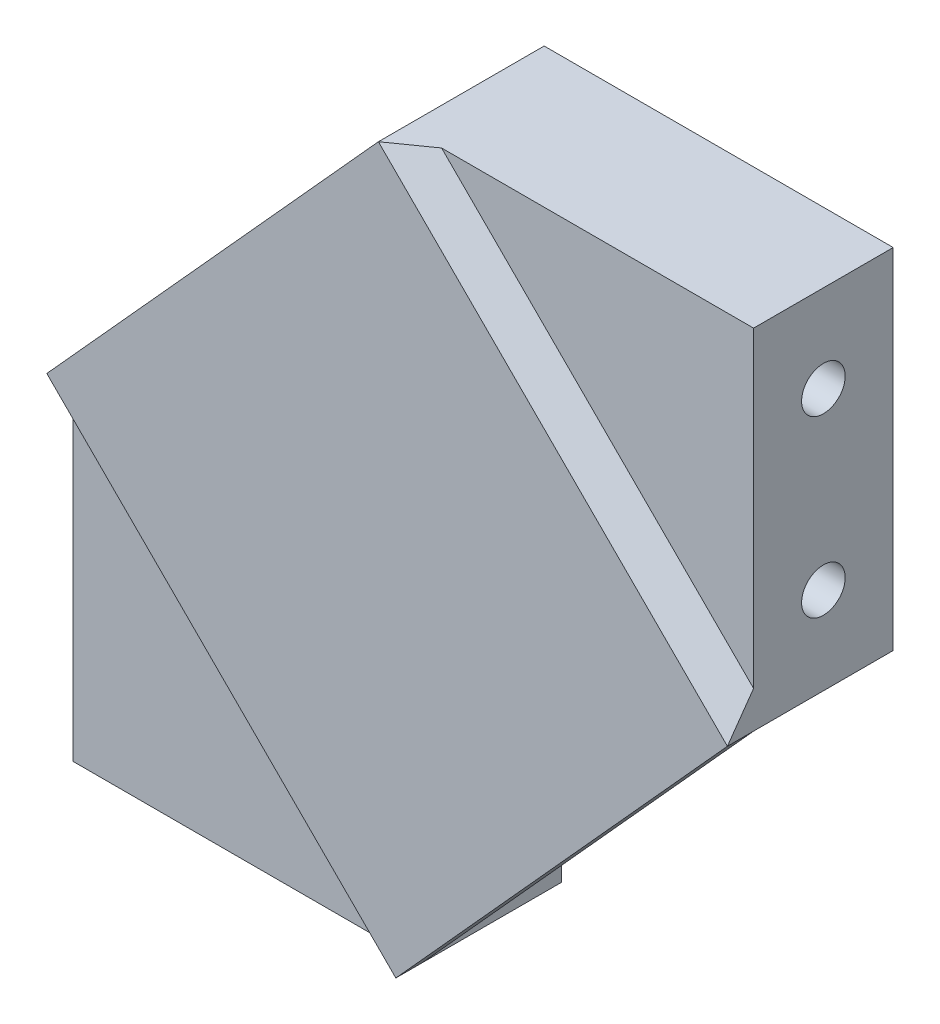
ISO-10303-21;
HEADER;
FILE_DESCRIPTION(('STEP AP214'),'2;1');
FILE_NAME('part.step','',(''),(''),'','','');
FILE_SCHEMA(('AUTOMOTIVE_DESIGN { 1 0 10303 214 1 1 1 1 }'));
ENDSEC;
DATA;
#1=APPLICATION_CONTEXT('core data for automotive mechanical design processes');
#2=APPLICATION_PROTOCOL_DEFINITION('international standard','automotive_design',2000,#1);
#3=PRODUCT_CONTEXT('',#1,'mechanical');
#4=PRODUCT('Part','Part','',(#3));
#5=PRODUCT_RELATED_PRODUCT_CATEGORY('part','',(#4));
#6=PRODUCT_DEFINITION_FORMATION('','',#4);
#7=PRODUCT_DEFINITION_CONTEXT('part definition',#1,'design');
#8=PRODUCT_DEFINITION('design','',#6,#7);
#9=PRODUCT_DEFINITION_SHAPE('','',#8);
#10=(LENGTH_UNIT() NAMED_UNIT(*) SI_UNIT(.MILLI.,.METRE.));
#11=(NAMED_UNIT(*) PLANE_ANGLE_UNIT() SI_UNIT($,.RADIAN.));
#12=(NAMED_UNIT(*) SI_UNIT($,.STERADIAN.) SOLID_ANGLE_UNIT());
#13=UNCERTAINTY_MEASURE_WITH_UNIT(LENGTH_MEASURE(1.E-05),#10,'distance_accuracy_value','');
#14=(GEOMETRIC_REPRESENTATION_CONTEXT(3) GLOBAL_UNCERTAINTY_ASSIGNED_CONTEXT((#13)) GLOBAL_UNIT_ASSIGNED_CONTEXT((#10,
#11,#12)) REPRESENTATION_CONTEXT('',''));
#15=CARTESIAN_POINT('',(0.,0.,0.));
#16=DIRECTION('',(0.,0.,1.));
#17=DIRECTION('',(1.,0.,0.));
#18=AXIS2_PLACEMENT_3D('',#15,#16,#17);
#19=CARTESIAN_POINT('',(0.,20.,8.));
#20=DIRECTION('',(0.,0.,-1.));
#21=DIRECTION('',(-1.,0.,0.));
#22=AXIS2_PLACEMENT_3D('',#19,#20,#21);
#23=PLANE('',#22);
#24=DIRECTION('',(-0.670913323969126,-0.741535779123771,0.));
#25=VECTOR('',#24,1.);
#26=CARTESIAN_POINT('',(-19.,-0.999999999999999,8.));
#27=LINE('',#26,#25);
#28=CARTESIAN_POINT('',(0.,20.,8.));
#29=VERTEX_POINT('',#28);
#30=CARTESIAN_POINT('',(-19.,-0.999999999999999,8.));
#31=VERTEX_POINT('',#30);
#32=EDGE_CURVE('E154',#29,#31,#27,.T.);
#33=ORIENTED_EDGE('',*,*,#32,.F.);
#34=DIRECTION('',(0.,-1.,0.));
#35=VECTOR('',#34,1.);
#36=CARTESIAN_POINT('',(0.,0.,8.));
#37=LINE('',#36,#35);
#38=CARTESIAN_POINT('',(0.,0.,8.));
#39=VERTEX_POINT('',#38);
#40=EDGE_CURVE('E347',#29,#39,#37,.T.);
#41=ORIENTED_EDGE('',*,*,#40,.T.);
#42=DIRECTION('',(1.,0.,0.));
#43=VECTOR('',#42,1.);
#44=CARTESIAN_POINT('',(0.,0.,8.));
#45=LINE('',#44,#43);
#46=CARTESIAN_POINT('',(20.,0.,8.));
#47=VERTEX_POINT('',#46);
#48=EDGE_CURVE('E353',#39,#47,#45,.T.);
#49=ORIENTED_EDGE('',*,*,#48,.T.);
#50=DIRECTION('',(0.670913323969126,0.741535779123771,0.));
#51=VECTOR('',#50,1.);
#52=CARTESIAN_POINT('',(1.,-21.,8.));
#53=LINE('',#52,#51);
#54=CARTESIAN_POINT('',(1.,-21.,8.));
#55=VERTEX_POINT('',#54);
#56=EDGE_CURVE('E164',#55,#47,#53,.T.);
#57=ORIENTED_EDGE('',*,*,#56,.F.);
#58=DIRECTION('',(0.,1.,0.));
#59=VECTOR('',#58,1.);
#60=CARTESIAN_POINT('',(1.,-1.,8.));
#61=LINE('',#60,#59);
#62=CARTESIAN_POINT('',(1.,-1.,8.));
#63=VERTEX_POINT('',#62);
#64=EDGE_CURVE('E192',#55,#63,#61,.T.);
#65=ORIENTED_EDGE('',*,*,#64,.T.);
#66=DIRECTION('',(-1.,0.,0.));
#67=VECTOR('',#66,1.);
#68=CARTESIAN_POINT('',(1.,-1.,8.));
#69=LINE('',#68,#67);
#70=EDGE_CURVE('E195',#63,#31,#69,.T.);
#71=ORIENTED_EDGE('',*,*,#70,.T.);
#72=EDGE_LOOP('',(#33,#41,#49,#57,#65,#71));
#73=FACE_BOUND('',#72,.T.);
#74=ADVANCED_FACE('F33',(#73),#23,.T.);
#75=CARTESIAN_POINT('',(-19.,-21.,8.));
#76=DIRECTION('',(0.,0.,-1.));
#77=DIRECTION('',(-1.,0.,0.));
#78=AXIS2_PLACEMENT_3D('',#75,#76,#77);
#79=PLANE('',#78);
#80=DIRECTION('',(1.,0.,0.));
#81=VECTOR('',#80,1.);
#82=CARTESIAN_POINT('',(1.,-21.,8.));
#83=LINE('',#82,#81);
#84=CARTESIAN_POINT('',(-19.,-21.,8.));
#85=VERTEX_POINT('',#84);
#86=CARTESIAN_POINT('',(-1.12132034355963,-21.,8.));
#87=VERTEX_POINT('',#86);
#88=EDGE_CURVE('E188',#85,#87,#83,.T.);
#89=ORIENTED_EDGE('',*,*,#88,.T.);
#90=DIRECTION('',(-0.707106781186548,0.707106781186547,0.));
#91=VECTOR('',#90,1.);
#92=CARTESIAN_POINT('',(-20.0606601717798,-2.06066017177982,8.));
#93=LINE('',#92,#91);
#94=CARTESIAN_POINT('',(-19.,-3.12132034355963,8.));
#95=VERTEX_POINT('',#94);
#96=EDGE_CURVE('E137',#87,#95,#93,.T.);
#97=ORIENTED_EDGE('',*,*,#96,.T.);
#98=DIRECTION('',(0.,-1.,0.));
#99=VECTOR('',#98,1.);
#100=CARTESIAN_POINT('',(-19.,-0.999999999999999,8.));
#101=LINE('',#100,#99);
#102=EDGE_CURVE('E186',#95,#85,#101,.T.);
#103=ORIENTED_EDGE('',*,*,#102,.T.);
#104=EDGE_LOOP('',(#89,#97,#103));
#105=FACE_BOUND('',#104,.T.);
#106=ADVANCED_FACE('F249',(#105),#79,.F.);
#107=CARTESIAN_POINT('',(-19.,-0.999999999999999,8.));
#108=DIRECTION('',(1.,0.,0.));
#109=DIRECTION('',(0.,1.,0.));
#110=AXIS2_PLACEMENT_3D('',#107,#108,#109);
#111=PLANE('',#110);
#112=CARTESIAN_POINT('',(-19.,-6.,4.));
#113=DIRECTION('',(1.,0.,0.));
#114=DIRECTION('',(0.,0.,-1.));
#115=AXIS2_PLACEMENT_3D('',#112,#113,#114);
#116=CIRCLE('',#115,1.24999999999999);
#117=CARTESIAN_POINT('',(-19.,-6.,2.75));
#118=VERTEX_POINT('',#117);
#119=EDGE_CURVE('E169',#118,#118,#116,.T.);
#120=ORIENTED_EDGE('',*,*,#119,.T.);
#121=EDGE_LOOP('',(#120));
#122=FACE_BOUND('',#121,.T.);
#123=CARTESIAN_POINT('',(-19.,-16.,3.99999999999999));
#124=DIRECTION('',(1.,0.,0.));
#125=DIRECTION('',(0.,0.,-1.));
#126=AXIS2_PLACEMENT_3D('',#123,#124,#125);
#127=CIRCLE('',#126,1.24999999999999);
#128=CARTESIAN_POINT('',(-19.,-16.,2.75));
#129=VERTEX_POINT('',#128);
#130=EDGE_CURVE('E179',#129,#129,#127,.T.);
#131=ORIENTED_EDGE('',*,*,#130,.T.);
#132=EDGE_LOOP('',(#131));
#133=FACE_BOUND('',#132,.T.);
#134=DIRECTION('',(0.,-1.,0.));
#135=VECTOR('',#134,1.);
#136=CARTESIAN_POINT('',(-19.,-0.999999999999999,0.));
#137=LINE('',#136,#135);
#138=CARTESIAN_POINT('',(-19.,-0.999999999999999,0.));
#139=VERTEX_POINT('',#138);
#140=CARTESIAN_POINT('',(-19.,-21.,0.));
#141=VERTEX_POINT('',#140);
#142=EDGE_CURVE('E185',#139,#141,#137,.T.);
#143=ORIENTED_EDGE('',*,*,#142,.T.);
#144=DIRECTION('',(0.,0.,-1.));
#145=VECTOR('',#144,1.);
#146=CARTESIAN_POINT('',(-19.,-21.,8.));
#147=LINE('',#146,#145);
#148=EDGE_CURVE('E140',#85,#141,#147,.T.);
#149=ORIENTED_EDGE('',*,*,#148,.F.);
#150=ORIENTED_EDGE('',*,*,#102,.F.);
#151=DIRECTION('',(0.,-0.816496580927723,-0.57735026918963));
#152=VECTOR('',#151,1.);
#153=CARTESIAN_POINT('',(-19.,-1.70710678118655,9.));
#154=LINE('',#153,#152);
#155=CARTESIAN_POINT('',(-19.,-0.999999999999999,9.5));
#156=VERTEX_POINT('',#155);
#157=EDGE_CURVE('E125',#95,#156,#154,.F.);
#158=ORIENTED_EDGE('',*,*,#157,.T.);
#159=DIRECTION('',(0.,0.,1.));
#160=VECTOR('',#159,1.);
#161=CARTESIAN_POINT('',(-19.,-0.999999999999999,9.5));
#162=LINE('',#161,#160);
#163=EDGE_CURVE('E148',#31,#156,#162,.T.);
#164=ORIENTED_EDGE('',*,*,#163,.F.);
#165=DIRECTION('',(0.,0.,-1.));
#166=VECTOR('',#165,1.);
#167=CARTESIAN_POINT('',(-19.,-0.999999999999999,8.));
#168=LINE('',#167,#166);
#169=EDGE_CURVE('E198',#31,#139,#168,.T.);
#170=ORIENTED_EDGE('',*,*,#169,.T.);
#171=EDGE_LOOP('',(#143,#149,#150,#158,#164,#170));
#172=FACE_BOUND('',#171,.T.);
#173=ADVANCED_FACE('F220',(#122,#133,#172),#111,.F.);
#174=CARTESIAN_POINT('',(1.,-21.,8.));
#175=DIRECTION('',(0.,1.,0.));
#176=DIRECTION('',(-1.,0.,0.));
#177=AXIS2_PLACEMENT_3D('',#174,#175,#176);
#178=PLANE('',#177);
#179=DIRECTION('',(1.,0.,0.));
#180=VECTOR('',#179,1.);
#181=CARTESIAN_POINT('',(1.,-21.,0.));
#182=LINE('',#181,#180);
#183=CARTESIAN_POINT('',(1.,-21.,0.));
#184=VERTEX_POINT('',#183);
#185=EDGE_CURVE('E201',#141,#184,#182,.T.);
#186=ORIENTED_EDGE('',*,*,#185,.T.);
#187=DIRECTION('',(0.,0.,-1.));
#188=VECTOR('',#187,1.);
#189=CARTESIAN_POINT('',(1.,-21.,8.));
#190=LINE('',#189,#188);
#191=EDGE_CURVE('E210',#55,#184,#190,.T.);
#192=ORIENTED_EDGE('',*,*,#191,.F.);
#193=DIRECTION('',(0.,0.,1.));
#194=VECTOR('',#193,1.);
#195=CARTESIAN_POINT('',(1.,-21.,8.));
#196=LINE('',#195,#194);
#197=CARTESIAN_POINT('',(1.,-21.,9.50000000000001));
#198=VERTEX_POINT('',#197);
#199=EDGE_CURVE('E146',#55,#198,#196,.T.);
#200=ORIENTED_EDGE('',*,*,#199,.T.);
#201=DIRECTION('',(0.816496580927723,0.,0.57735026918963));
#202=VECTOR('',#201,1.);
#203=CARTESIAN_POINT('',(0.292893218813449,-21.,9.));
#204=LINE('',#203,#202);
#205=EDGE_CURVE('E79',#198,#87,#204,.F.);
#206=ORIENTED_EDGE('',*,*,#205,.T.);
#207=ORIENTED_EDGE('',*,*,#88,.F.);
#208=ORIENTED_EDGE('',*,*,#148,.T.);
#209=EDGE_LOOP('',(#186,#192,#200,#206,#207,#208));
#210=FACE_BOUND('',#209,.T.);
#211=ADVANCED_FACE('F216',(#210),#178,.F.);
#212=CARTESIAN_POINT('',(1.,-1.,8.));
#213=DIRECTION('',(-1.,0.,0.));
#214=DIRECTION('',(0.,-1.,0.));
#215=AXIS2_PLACEMENT_3D('',#212,#213,#214);
#216=PLANE('',#215);
#217=CARTESIAN_POINT('',(1.,-6.,4.));
#218=DIRECTION('',(-1.,0.,0.));
#219=DIRECTION('',(0.,-1.,0.));
#220=AXIS2_PLACEMENT_3D('',#217,#218,#219);
#221=CIRCLE('',#220,1.24999999999999);
#222=CARTESIAN_POINT('',(1.,-7.24999999999999,4.));
#223=VERTEX_POINT('',#222);
#224=EDGE_CURVE('E176',#223,#223,#221,.T.);
#225=ORIENTED_EDGE('',*,*,#224,.T.);
#226=EDGE_LOOP('',(#225));
#227=FACE_BOUND('',#226,.T.);
#228=CARTESIAN_POINT('',(1.,-16.,3.99999999999999));
#229=DIRECTION('',(-1.,0.,0.));
#230=DIRECTION('',(0.,-1.,0.));
#231=AXIS2_PLACEMENT_3D('',#228,#229,#230);
#232=CIRCLE('',#231,1.24999999999999);
#233=CARTESIAN_POINT('',(1.,-17.25,3.99999999999999));
#234=VERTEX_POINT('',#233);
#235=EDGE_CURVE('E182',#234,#234,#232,.T.);
#236=ORIENTED_EDGE('',*,*,#235,.T.);
#237=EDGE_LOOP('',(#236));
#238=FACE_BOUND('',#237,.T.);
#239=DIRECTION('',(0.,1.,0.));
#240=VECTOR('',#239,1.);
#241=CARTESIAN_POINT('',(1.,-1.,0.));
#242=LINE('',#241,#240);
#243=CARTESIAN_POINT('',(1.,-1.,0.));
#244=VERTEX_POINT('',#243);
#245=EDGE_CURVE('E203',#184,#244,#242,.T.);
#246=ORIENTED_EDGE('',*,*,#245,.T.);
#247=DIRECTION('',(0.,0.,-1.));
#248=VECTOR('',#247,1.);
#249=CARTESIAN_POINT('',(1.,-1.,8.));
#250=LINE('',#249,#248);
#251=EDGE_CURVE('E207',#63,#244,#250,.T.);
#252=ORIENTED_EDGE('',*,*,#251,.F.);
#253=ORIENTED_EDGE('',*,*,#64,.F.);
#254=ORIENTED_EDGE('',*,*,#191,.T.);
#255=EDGE_LOOP('',(#246,#252,#253,#254));
#256=FACE_BOUND('',#255,.T.);
#257=ADVANCED_FACE('F226',(#227,#238,#256),#216,.F.);
#258=CARTESIAN_POINT('',(1.,-1.,8.));
#259=DIRECTION('',(0.,-1.,0.));
#260=DIRECTION('',(1.,0.,0.));
#261=AXIS2_PLACEMENT_3D('',#258,#259,#260);
#262=PLANE('',#261);
#263=DIRECTION('',(-1.,0.,0.));
#264=VECTOR('',#263,1.);
#265=CARTESIAN_POINT('',(1.,-1.,0.));
#266=LINE('',#265,#264);
#267=EDGE_CURVE('E189',#244,#139,#266,.T.);
#268=ORIENTED_EDGE('',*,*,#267,.T.);
#269=ORIENTED_EDGE('',*,*,#169,.F.);
#270=ORIENTED_EDGE('',*,*,#70,.F.);
#271=ORIENTED_EDGE('',*,*,#251,.T.);
#272=EDGE_LOOP('',(#268,#269,#270,#271));
#273=FACE_BOUND('',#272,.T.);
#274=ADVANCED_FACE('F230',(#273),#262,.F.);
#275=CARTESIAN_POINT('',(-19.,-21.,0.));
#276=DIRECTION('',(0.,0.,-1.));
#277=DIRECTION('',(-1.,0.,0.));
#278=AXIS2_PLACEMENT_3D('',#275,#276,#277);
#279=PLANE('',#278);
#280=ORIENTED_EDGE('',*,*,#142,.F.);
#281=ORIENTED_EDGE('',*,*,#267,.F.);
#282=ORIENTED_EDGE('',*,*,#245,.F.);
#283=ORIENTED_EDGE('',*,*,#185,.F.);
#284=EDGE_LOOP('',(#280,#281,#282,#283));
#285=FACE_BOUND('',#284,.T.);
#286=ADVANCED_FACE('F223',(#285),#279,.T.);
#287=CARTESIAN_POINT('',(20.,-16.,3.99999999999999));
#288=DIRECTION('',(1.,0.,0.));
#289=DIRECTION('',(0.,0.,-1.));
#290=AXIS2_PLACEMENT_3D('',#287,#288,#289);
#291=CYLINDRICAL_SURFACE('',#290,1.24999999999999);
#292=ORIENTED_EDGE('',*,*,#130,.F.);
#293=EDGE_LOOP('',(#292));
#294=FACE_BOUND('',#293,.T.);
#295=ORIENTED_EDGE('',*,*,#235,.F.);
#296=EDGE_LOOP('',(#295));
#297=FACE_BOUND('',#296,.T.);
#298=ADVANCED_FACE('F261',(#294,#297),#291,.F.);
#299=CARTESIAN_POINT('',(20.,-6.,4.));
#300=DIRECTION('',(1.,0.,0.));
#301=DIRECTION('',(0.,0.,-1.));
#302=AXIS2_PLACEMENT_3D('',#299,#300,#301);
#303=CYLINDRICAL_SURFACE('',#302,1.24999999999999);
#304=ORIENTED_EDGE('',*,*,#119,.F.);
#305=EDGE_LOOP('',(#304));
#306=FACE_BOUND('',#305,.T.);
#307=ORIENTED_EDGE('',*,*,#224,.F.);
#308=EDGE_LOOP('',(#307));
#309=FACE_BOUND('',#308,.T.);
#310=ADVANCED_FACE('F258',(#306,#309),#303,.F.);
#311=CARTESIAN_POINT('',(-19.,-0.999999999999999,9.5));
#312=DIRECTION('',(0.741535779123771,-0.670913323969126,0.));
#313=DIRECTION('',(0.670913323969126,0.741535779123771,0.));
#314=AXIS2_PLACEMENT_3D('',#311,#312,#313);
#315=PLANE('',#314);
#316=ORIENTED_EDGE('',*,*,#32,.T.);
#317=ORIENTED_EDGE('',*,*,#163,.T.);
#318=DIRECTION('',(-0.670913323969126,-0.741535779123771,0.));
#319=VECTOR('',#318,1.);
#320=CARTESIAN_POINT('',(-19.,-0.999999999999999,9.5));
#321=LINE('',#320,#319);
#322=CARTESIAN_POINT('',(0.,20.,9.50000000000001));
#323=VERTEX_POINT('',#322);
#324=EDGE_CURVE('E54',#323,#156,#321,.T.);
#325=ORIENTED_EDGE('',*,*,#324,.F.);
#326=DIRECTION('',(0.,0.,1.));
#327=VECTOR('',#326,1.);
#328=CARTESIAN_POINT('',(0.,20.,8.));
#329=LINE('',#328,#327);
#330=EDGE_CURVE('E41',#29,#323,#329,.T.);
#331=ORIENTED_EDGE('',*,*,#330,.F.);
#332=EDGE_LOOP('',(#316,#317,#325,#331));
#333=FACE_BOUND('',#332,.T.);
#334=ADVANCED_FACE('F152',(#333),#315,.F.);
#335=CARTESIAN_POINT('',(1.,-21.,9.5));
#336=DIRECTION('',(-0.741535779123771,0.670913323969126,0.));
#337=DIRECTION('',(-0.670913323969126,-0.741535779123771,0.));
#338=AXIS2_PLACEMENT_3D('',#335,#336,#337);
#339=PLANE('',#338);
#340=ORIENTED_EDGE('',*,*,#56,.T.);
#341=DIRECTION('',(0.,0.,1.));
#342=VECTOR('',#341,1.);
#343=CARTESIAN_POINT('',(20.,0.,9.5));
#344=LINE('',#343,#342);
#345=CARTESIAN_POINT('',(20.,0.,9.5));
#346=VERTEX_POINT('',#345);
#347=EDGE_CURVE('E11',#47,#346,#344,.T.);
#348=ORIENTED_EDGE('',*,*,#347,.T.);
#349=DIRECTION('',(0.670913323969126,0.741535779123771,0.));
#350=VECTOR('',#349,1.);
#351=CARTESIAN_POINT('',(1.,-21.,9.5));
#352=LINE('',#351,#350);
#353=EDGE_CURVE('E48',#198,#346,#352,.T.);
#354=ORIENTED_EDGE('',*,*,#353,.F.);
#355=ORIENTED_EDGE('',*,*,#199,.F.);
#356=EDGE_LOOP('',(#340,#348,#354,#355));
#357=FACE_BOUND('',#356,.T.);
#358=ADVANCED_FACE('F235',(#357),#339,.F.);
#359=CARTESIAN_POINT('',(0.,20.,9.5));
#360=DIRECTION('',(0.,0.,-1.));
#361=DIRECTION('',(-1.,0.,0.));
#362=AXIS2_PLACEMENT_3D('',#359,#360,#361);
#363=PLANE('',#362);
#364=ORIENTED_EDGE('',*,*,#324,.T.);
#365=DIRECTION('',(0.707106781186548,-0.707106781186547,0.));
#366=VECTOR('',#365,1.);
#367=CARTESIAN_POINT('',(-19.,-0.999999999999999,9.5));
#368=LINE('',#367,#366);
#369=EDGE_CURVE('E159',#156,#198,#368,.T.);
#370=ORIENTED_EDGE('',*,*,#369,.T.);
#371=ORIENTED_EDGE('',*,*,#353,.T.);
#372=DIRECTION('',(-0.707106781186548,0.707106781186548,0.));
#373=VECTOR('',#372,1.);
#374=CARTESIAN_POINT('',(0.,20.,9.5));
#375=LINE('',#374,#373);
#376=EDGE_CURVE('E162',#346,#323,#375,.T.);
#377=ORIENTED_EDGE('',*,*,#376,.T.);
#378=EDGE_LOOP('',(#364,#370,#371,#377));
#379=FACE_BOUND('',#378,.T.);
#380=ADVANCED_FACE('F236',(#379),#363,.F.);
#381=CARTESIAN_POINT('',(0.,20.,8.));
#382=DIRECTION('',(0.,0.,-1.));
#383=DIRECTION('',(-1.,0.,0.));
#384=AXIS2_PLACEMENT_3D('',#381,#382,#383);
#385=PLANE('',#384);
#386=DIRECTION('',(-1.,0.,0.));
#387=VECTOR('',#386,1.);
#388=CARTESIAN_POINT('',(0.,20.,8.));
#389=LINE('',#388,#387);
#390=CARTESIAN_POINT('',(20.,20.,8.));
#391=VERTEX_POINT('',#390);
#392=CARTESIAN_POINT('',(2.12132034355963,20.,8.));
#393=VERTEX_POINT('',#392);
#394=EDGE_CURVE('E121',#391,#393,#389,.T.);
#395=ORIENTED_EDGE('',*,*,#394,.T.);
#396=DIRECTION('',(0.707106781186548,-0.707106781186548,0.));
#397=VECTOR('',#396,1.);
#398=CARTESIAN_POINT('',(21.0606601717798,1.06066017177981,8.));
#399=LINE('',#398,#397);
#400=CARTESIAN_POINT('',(20.,2.12132034355963,8.));
#401=VERTEX_POINT('',#400);
#402=EDGE_CURVE('E130',#393,#401,#399,.T.);
#403=ORIENTED_EDGE('',*,*,#402,.T.);
#404=DIRECTION('',(0.,1.,0.));
#405=VECTOR('',#404,1.);
#406=CARTESIAN_POINT('',(20.,0.,8.));
#407=LINE('',#406,#405);
#408=EDGE_CURVE('E132',#401,#391,#407,.T.);
#409=ORIENTED_EDGE('',*,*,#408,.T.);
#410=EDGE_LOOP('',(#395,#403,#409));
#411=FACE_BOUND('',#410,.T.);
#412=ADVANCED_FACE('F129',(#411),#385,.F.);
#413=CARTESIAN_POINT('',(0.,0.,8.));
#414=DIRECTION('',(1.,0.,0.));
#415=DIRECTION('',(0.,0.,-1.));
#416=AXIS2_PLACEMENT_3D('',#413,#414,#415);
#417=PLANE('',#416);
#418=CARTESIAN_POINT('',(0.,15.,4.));
#419=DIRECTION('',(1.,0.,0.));
#420=DIRECTION('',(0.,0.,-1.));
#421=AXIS2_PLACEMENT_3D('',#418,#419,#420);
#422=CIRCLE('',#421,1.24999999999999);
#423=CARTESIAN_POINT('',(0.,15.,2.75000000000001));
#424=VERTEX_POINT('',#423);
#425=EDGE_CURVE('E314',#424,#424,#422,.T.);
#426=ORIENTED_EDGE('',*,*,#425,.T.);
#427=EDGE_LOOP('',(#426));
#428=FACE_BOUND('',#427,.T.);
#429=CARTESIAN_POINT('',(0.,5.,4.));
#430=DIRECTION('',(1.,0.,0.));
#431=DIRECTION('',(0.,0.,-1.));
#432=AXIS2_PLACEMENT_3D('',#429,#430,#431);
#433=CIRCLE('',#432,1.24999999999999);
#434=CARTESIAN_POINT('',(0.,5.,2.75000000000001));
#435=VERTEX_POINT('',#434);
#436=EDGE_CURVE('E318',#435,#435,#433,.T.);
#437=ORIENTED_EDGE('',*,*,#436,.T.);
#438=EDGE_LOOP('',(#437));
#439=FACE_BOUND('',#438,.T.);
#440=DIRECTION('',(0.,-1.,0.));
#441=VECTOR('',#440,1.);
#442=CARTESIAN_POINT('',(0.,0.,0.));
#443=LINE('',#442,#441);
#444=CARTESIAN_POINT('',(0.,20.,0.));
#445=VERTEX_POINT('',#444);
#446=CARTESIAN_POINT('',(0.,0.,0.));
#447=VERTEX_POINT('',#446);
#448=EDGE_CURVE('E324',#445,#447,#443,.T.);
#449=ORIENTED_EDGE('',*,*,#448,.T.);
#450=DIRECTION('',(0.,0.,-1.));
#451=VECTOR('',#450,1.);
#452=CARTESIAN_POINT('',(0.,0.,8.));
#453=LINE('',#452,#451);
#454=EDGE_CURVE('E171',#39,#447,#453,.T.);
#455=ORIENTED_EDGE('',*,*,#454,.F.);
#456=ORIENTED_EDGE('',*,*,#40,.F.);
#457=DIRECTION('',(0.,0.,-1.));
#458=VECTOR('',#457,1.);
#459=CARTESIAN_POINT('',(0.,20.,8.));
#460=LINE('',#459,#458);
#461=EDGE_CURVE('E134',#29,#445,#460,.T.);
#462=ORIENTED_EDGE('',*,*,#461,.T.);
#463=EDGE_LOOP('',(#449,#455,#456,#462));
#464=FACE_BOUND('',#463,.T.);
#465=ADVANCED_FACE('F243',(#428,#439,#464),#417,.F.);
#466=CARTESIAN_POINT('',(0.,0.,8.));
#467=DIRECTION('',(0.,1.,0.));
#468=DIRECTION('',(0.,0.,1.));
#469=AXIS2_PLACEMENT_3D('',#466,#467,#468);
#470=PLANE('',#469);
#471=DIRECTION('',(1.,0.,0.));
#472=VECTOR('',#471,1.);
#473=CARTESIAN_POINT('',(0.,0.,0.));
#474=LINE('',#473,#472);
#475=CARTESIAN_POINT('',(20.,0.,0.));
#476=VERTEX_POINT('',#475);
#477=EDGE_CURVE('E334',#447,#476,#474,.T.);
#478=ORIENTED_EDGE('',*,*,#477,.T.);
#479=DIRECTION('',(0.,0.,-1.));
#480=VECTOR('',#479,1.);
#481=CARTESIAN_POINT('',(20.,0.,8.));
#482=LINE('',#481,#480);
#483=EDGE_CURVE('E351',#47,#476,#482,.T.);
#484=ORIENTED_EDGE('',*,*,#483,.F.);
#485=ORIENTED_EDGE('',*,*,#48,.F.);
#486=ORIENTED_EDGE('',*,*,#454,.T.);
#487=EDGE_LOOP('',(#478,#484,#485,#486));
#488=FACE_BOUND('',#487,.T.);
#489=ADVANCED_FACE('F303',(#488),#470,.F.);
#490=CARTESIAN_POINT('',(20.,0.,8.));
#491=DIRECTION('',(-1.,0.,0.));
#492=DIRECTION('',(0.,0.,1.));
#493=AXIS2_PLACEMENT_3D('',#490,#491,#492);
#494=PLANE('',#493);
#495=CARTESIAN_POINT('',(20.,15.,4.));
#496=DIRECTION('',(1.,0.,0.));
#497=DIRECTION('',(0.,0.,-1.));
#498=AXIS2_PLACEMENT_3D('',#495,#496,#497);
#499=CIRCLE('',#498,1.24999999999999);
#500=CARTESIAN_POINT('',(20.,15.,2.75000000000001));
#501=VERTEX_POINT('',#500);
#502=EDGE_CURVE('E361',#501,#501,#499,.T.);
#503=ORIENTED_EDGE('',*,*,#502,.F.);
#504=EDGE_LOOP('',(#503));
#505=FACE_BOUND('',#504,.T.);
#506=CARTESIAN_POINT('',(20.,5.,4.));
#507=DIRECTION('',(1.,0.,0.));
#508=DIRECTION('',(0.,0.,-1.));
#509=AXIS2_PLACEMENT_3D('',#506,#507,#508);
#510=CIRCLE('',#509,1.24999999999999);
#511=CARTESIAN_POINT('',(20.,5.,2.75000000000001));
#512=VERTEX_POINT('',#511);
#513=EDGE_CURVE('E339',#512,#512,#510,.T.);
#514=ORIENTED_EDGE('',*,*,#513,.F.);
#515=EDGE_LOOP('',(#514));
#516=FACE_BOUND('',#515,.T.);
#517=DIRECTION('',(0.,1.,0.));
#518=VECTOR('',#517,1.);
#519=CARTESIAN_POINT('',(20.,0.,0.));
#520=LINE('',#519,#518);
#521=CARTESIAN_POINT('',(20.,20.,0.));
#522=VERTEX_POINT('',#521);
#523=EDGE_CURVE('E337',#476,#522,#520,.T.);
#524=ORIENTED_EDGE('',*,*,#523,.T.);
#525=DIRECTION('',(0.,0.,-1.));
#526=VECTOR('',#525,1.);
#527=CARTESIAN_POINT('',(20.,20.,8.));
#528=LINE('',#527,#526);
#529=EDGE_CURVE('E349',#391,#522,#528,.T.);
#530=ORIENTED_EDGE('',*,*,#529,.F.);
#531=ORIENTED_EDGE('',*,*,#408,.F.);
#532=DIRECTION('',(0.,0.816496580927723,-0.577350269189631));
#533=VECTOR('',#532,1.);
#534=CARTESIAN_POINT('',(20.,0.707106781186554,9.));
#535=LINE('',#534,#533);
#536=EDGE_CURVE('E124',#401,#346,#535,.F.);
#537=ORIENTED_EDGE('',*,*,#536,.T.);
#538=ORIENTED_EDGE('',*,*,#347,.F.);
#539=ORIENTED_EDGE('',*,*,#483,.T.);
#540=EDGE_LOOP('',(#524,#530,#531,#537,#538,#539));
#541=FACE_BOUND('',#540,.T.);
#542=ADVANCED_FACE('F300',(#505,#516,#541),#494,.F.);
#543=CARTESIAN_POINT('',(0.,20.,8.));
#544=DIRECTION('',(0.,-1.,0.));
#545=DIRECTION('',(0.,0.,-1.));
#546=AXIS2_PLACEMENT_3D('',#543,#544,#545);
#547=PLANE('',#546);
#548=DIRECTION('',(-1.,0.,0.));
#549=VECTOR('',#548,1.);
#550=CARTESIAN_POINT('',(0.,20.,0.));
#551=LINE('',#550,#549);
#552=EDGE_CURVE('E345',#522,#445,#551,.T.);
#553=ORIENTED_EDGE('',*,*,#552,.T.);
#554=ORIENTED_EDGE('',*,*,#461,.F.);
#555=ORIENTED_EDGE('',*,*,#330,.T.);
#556=DIRECTION('',(-0.816496580927723,0.,0.577350269189631));
#557=VECTOR('',#556,1.);
#558=CARTESIAN_POINT('',(0.707106781186554,20.,9.));
#559=LINE('',#558,#557);
#560=EDGE_CURVE('E68',#323,#393,#559,.F.);
#561=ORIENTED_EDGE('',*,*,#560,.T.);
#562=ORIENTED_EDGE('',*,*,#394,.F.);
#563=ORIENTED_EDGE('',*,*,#529,.T.);
#564=EDGE_LOOP('',(#553,#554,#555,#561,#562,#563));
#565=FACE_BOUND('',#564,.T.);
#566=ADVANCED_FACE('F118',(#565),#547,.F.);
#567=CARTESIAN_POINT('',(0.,20.,0.));
#568=DIRECTION('',(0.,0.,-1.));
#569=DIRECTION('',(-1.,0.,0.));
#570=AXIS2_PLACEMENT_3D('',#567,#568,#569);
#571=PLANE('',#570);
#572=ORIENTED_EDGE('',*,*,#448,.F.);
#573=ORIENTED_EDGE('',*,*,#552,.F.);
#574=ORIENTED_EDGE('',*,*,#523,.F.);
#575=ORIENTED_EDGE('',*,*,#477,.F.);
#576=EDGE_LOOP('',(#572,#573,#574,#575));
#577=FACE_BOUND('',#576,.T.);
#578=ADVANCED_FACE('F289',(#577),#571,.T.);
#579=CARTESIAN_POINT('',(20.,5.,4.));
#580=DIRECTION('',(1.,0.,0.));
#581=DIRECTION('',(0.,0.,-1.));
#582=AXIS2_PLACEMENT_3D('',#579,#580,#581);
#583=CYLINDRICAL_SURFACE('',#582,1.24999999999999);
#584=ORIENTED_EDGE('',*,*,#513,.T.);
#585=EDGE_LOOP('',(#584));
#586=FACE_BOUND('',#585,.T.);
#587=ORIENTED_EDGE('',*,*,#436,.F.);
#588=EDGE_LOOP('',(#587));
#589=FACE_BOUND('',#588,.T.);
#590=ADVANCED_FACE('F283',(#586,#589),#583,.F.);
#591=CARTESIAN_POINT('',(20.,15.,4.));
#592=DIRECTION('',(1.,0.,0.));
#593=DIRECTION('',(0.,0.,-1.));
#594=AXIS2_PLACEMENT_3D('',#591,#592,#593);
#595=CYLINDRICAL_SURFACE('',#594,1.24999999999999);
#596=ORIENTED_EDGE('',*,*,#502,.T.);
#597=EDGE_LOOP('',(#596));
#598=FACE_BOUND('',#597,.T.);
#599=ORIENTED_EDGE('',*,*,#425,.F.);
#600=EDGE_LOOP('',(#599));
#601=FACE_BOUND('',#600,.T.);
#602=ADVANCED_FACE('F278',(#598,#601),#595,.F.);
#603=CARTESIAN_POINT('',(-19.,-0.999999999999999,9.50000000000001));
#604=DIRECTION('',(-0.500000000000003,-0.500000000000003,0.707106781186544));
#605=DIRECTION('',(0.,-0.816496580927723,-0.57735026918963));
#606=AXIS2_PLACEMENT_3D('',#603,#604,#605);
#607=PLANE('',#606);
#608=ORIENTED_EDGE('',*,*,#157,.F.);
#609=ORIENTED_EDGE('',*,*,#96,.F.);
#610=ORIENTED_EDGE('',*,*,#205,.F.);
#611=ORIENTED_EDGE('',*,*,#369,.F.);
#612=EDGE_LOOP('',(#608,#609,#610,#611));
#613=FACE_BOUND('',#612,.T.);
#614=ADVANCED_FACE('F160',(#613),#607,.T.);
#615=CARTESIAN_POINT('',(0.,20.,9.50000000000001));
#616=DIRECTION('',(0.500000000000003,0.500000000000003,0.707106781186543));
#617=DIRECTION('',(0.816496580927723,0.,-0.577350269189631));
#618=AXIS2_PLACEMENT_3D('',#615,#616,#617);
#619=PLANE('',#618);
#620=ORIENTED_EDGE('',*,*,#536,.F.);
#621=ORIENTED_EDGE('',*,*,#402,.F.);
#622=ORIENTED_EDGE('',*,*,#560,.F.);
#623=ORIENTED_EDGE('',*,*,#376,.F.);
#624=EDGE_LOOP('',(#620,#621,#622,#623));
#625=FACE_BOUND('',#624,.T.);
#626=ADVANCED_FACE('F35',(#625),#619,.T.);
#627=CLOSED_SHELL('',(#74,#106,#173,#211,#257,#274,#286,#298,#310,#334,#358,#380,#412,#465,#489,
#542,#566,#578,#590,#602,#614,#626));
#628=MANIFOLD_SOLID_BREP('B2',#627);
#629=ADVANCED_BREP_SHAPE_REPRESENTATION('',(#18,#628),#14);
#630=SHAPE_DEFINITION_REPRESENTATION(#9,#629);
ENDSEC;
END-ISO-10303-21;
